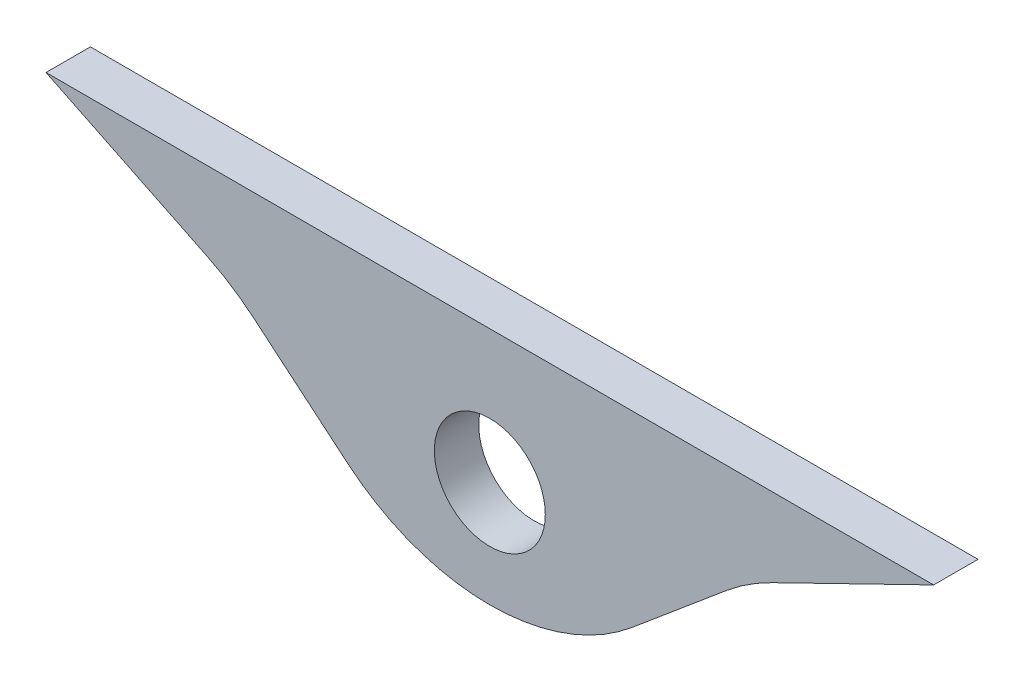
ISO-10303-21;
HEADER;
FILE_DESCRIPTION(('STEP AP214'),'2;1');
FILE_NAME('part.step','',(''),(''),'','','');
FILE_SCHEMA(('AUTOMOTIVE_DESIGN { 1 0 10303 214 1 1 1 1 }'));
ENDSEC;
DATA;
#1=APPLICATION_CONTEXT('core data for automotive mechanical design processes');
#2=APPLICATION_PROTOCOL_DEFINITION('international standard','automotive_design',2000,#1);
#3=PRODUCT_CONTEXT('',#1,'mechanical');
#4=PRODUCT('Part','Part','',(#3));
#5=PRODUCT_RELATED_PRODUCT_CATEGORY('part','',(#4));
#6=PRODUCT_DEFINITION_FORMATION('','',#4);
#7=PRODUCT_DEFINITION_CONTEXT('part definition',#1,'design');
#8=PRODUCT_DEFINITION('design','',#6,#7);
#9=PRODUCT_DEFINITION_SHAPE('','',#8);
#10=(LENGTH_UNIT() NAMED_UNIT(*) SI_UNIT(.MILLI.,.METRE.));
#11=(NAMED_UNIT(*) PLANE_ANGLE_UNIT() SI_UNIT($,.RADIAN.));
#12=(NAMED_UNIT(*) SI_UNIT($,.STERADIAN.) SOLID_ANGLE_UNIT());
#13=UNCERTAINTY_MEASURE_WITH_UNIT(LENGTH_MEASURE(1.E-05),#10,'distance_accuracy_value','');
#14=(GEOMETRIC_REPRESENTATION_CONTEXT(3) GLOBAL_UNCERTAINTY_ASSIGNED_CONTEXT((#13)) GLOBAL_UNIT_ASSIGNED_CONTEXT((#10,
#11,#12)) REPRESENTATION_CONTEXT('',''));
#15=CARTESIAN_POINT('',(0.,0.,0.));
#16=DIRECTION('',(0.,0.,1.));
#17=DIRECTION('',(1.,0.,0.));
#18=AXIS2_PLACEMENT_3D('',#15,#16,#17);
#19=CARTESIAN_POINT('',(0.,0.,2.));
#20=DIRECTION('',(0.,0.,-1.));
#21=DIRECTION('',(-1.,0.,0.));
#22=AXIS2_PLACEMENT_3D('',#19,#20,#21);
#23=PLANE('',#22);
#24=DIRECTION('',(0.766044443118979,-0.642787609686538,0.));
#25=VECTOR('',#24,1.);
#26=CARTESIAN_POINT('',(0.,-7.83244373599366,2.));
#27=LINE('',#26,#25);
#28=CARTESIAN_POINT('',(-10.6649206794372,1.11648727265698,2.));
#29=VERTEX_POINT('',#28);
#30=CARTESIAN_POINT('',(-6.42787609686538,-2.43881527386068,2.));
#31=VERTEX_POINT('',#30);
#32=EDGE_CURVE('E156',#29,#31,#27,.T.);
#33=ORIENTED_EDGE('',*,*,#32,.T.);
#34=CARTESIAN_POINT('',(0.,5.22162915732911,2.));
#35=DIRECTION('',(0.,0.,-1.));
#36=DIRECTION('',(-1.,0.,0.));
#37=AXIS2_PLACEMENT_3D('',#34,#35,#36);
#38=CIRCLE('',#37,10.);
#39=CARTESIAN_POINT('',(6.42787609686538,-2.43881527386069,2.));
#40=VERTEX_POINT('',#39);
#41=EDGE_CURVE('E62',#31,#40,#38,.F.);
#42=ORIENTED_EDGE('',*,*,#41,.T.);
#43=DIRECTION('',(0.766044443118979,0.642787609686538,0.));
#44=VECTOR('',#43,1.);
#45=CARTESIAN_POINT('',(0.,-7.83244373599366,2.));
#46=LINE('',#45,#44);
#47=CARTESIAN_POINT('',(10.6649206794372,1.11648727265698,2.));
#48=VERTEX_POINT('',#47);
#49=EDGE_CURVE('E116',#40,#48,#46,.T.);
#50=ORIENTED_EDGE('',*,*,#49,.T.);
#51=CARTESIAN_POINT('',(17.0927967763026,-6.54395715853281,2.));
#52=DIRECTION('',(0.,0.,-1.));
#53=DIRECTION('',(-1.,0.,0.));
#54=AXIS2_PLACEMENT_3D('',#51,#52,#53);
#55=CIRCLE('',#54,10.);
#56=CARTESIAN_POINT('',(12.7090853084118,2.44398330445889,2.));
#57=VERTEX_POINT('',#56);
#58=EDGE_CURVE('E11',#48,#57,#55,.T.);
#59=ORIENTED_EDGE('',*,*,#58,.T.);
#60=DIRECTION('',(0.898794046299169,0.438371146789072,0.));
#61=VECTOR('',#60,1.);
#62=CARTESIAN_POINT('',(11.6055049852419,1.90573121674889,2.));
#63=LINE('',#62,#61);
#64=CARTESIAN_POINT('',(20.,6.,2.));
#65=VERTEX_POINT('',#64);
#66=EDGE_CURVE('E104',#57,#65,#63,.T.);
#67=ORIENTED_EDGE('',*,*,#66,.T.);
#68=DIRECTION('',(-1.,0.,0.));
#69=VECTOR('',#68,1.);
#70=CARTESIAN_POINT('',(20.,6.,2.));
#71=LINE('',#70,#69);
#72=CARTESIAN_POINT('',(-20.,6.,2.));
#73=VERTEX_POINT('',#72);
#74=EDGE_CURVE('E109',#65,#73,#71,.T.);
#75=ORIENTED_EDGE('',*,*,#74,.T.);
#76=DIRECTION('',(0.898794046299169,-0.438371146789072,0.));
#77=VECTOR('',#76,1.);
#78=CARTESIAN_POINT('',(-11.6055049852419,1.90573121674889,2.));
#79=LINE('',#78,#77);
#80=CARTESIAN_POINT('',(-12.7090853084118,2.44398330445889,2.));
#81=VERTEX_POINT('',#80);
#82=EDGE_CURVE('E133',#73,#81,#79,.T.);
#83=ORIENTED_EDGE('',*,*,#82,.T.);
#84=CARTESIAN_POINT('',(-17.0927967763026,-6.54395715853281,2.));
#85=DIRECTION('',(0.,0.,-1.));
#86=DIRECTION('',(-1.,0.,0.));
#87=AXIS2_PLACEMENT_3D('',#84,#85,#86);
#88=CIRCLE('',#87,10.);
#89=EDGE_CURVE('E185',#81,#29,#88,.T.);
#90=ORIENTED_EDGE('',*,*,#89,.T.);
#91=EDGE_LOOP('',(#33,#42,#50,#59,#67,#75,#83,#90));
#92=FACE_BOUND('',#91,.T.);
#93=CARTESIAN_POINT('',(0.,0.,2.));
#94=DIRECTION('',(0.,0.,1.));
#95=DIRECTION('',(1.,0.,0.));
#96=AXIS2_PLACEMENT_3D('',#93,#94,#95);
#97=CIRCLE('',#96,2.5);
#98=CARTESIAN_POINT('',(2.5,0.,2.));
#99=VERTEX_POINT('',#98);
#100=EDGE_CURVE('E144',#99,#99,#97,.T.);
#101=ORIENTED_EDGE('',*,*,#100,.F.);
#102=EDGE_LOOP('',(#101));
#103=FACE_BOUND('',#102,.T.);
#104=ADVANCED_FACE('F39',(#92,#103),#23,.F.);
#105=CARTESIAN_POINT('',(0.,0.,0.));
#106=DIRECTION('',(0.,0.,-1.));
#107=DIRECTION('',(-1.,0.,0.));
#108=AXIS2_PLACEMENT_3D('',#105,#106,#107);
#109=PLANE('',#108);
#110=DIRECTION('',(0.766044443118979,0.642787609686538,0.));
#111=VECTOR('',#110,1.);
#112=CARTESIAN_POINT('',(0.,-7.83244373599366,0.));
#113=LINE('',#112,#111);
#114=CARTESIAN_POINT('',(6.42787609686538,-2.43881527386069,0.));
#115=VERTEX_POINT('',#114);
#116=CARTESIAN_POINT('',(10.6649206794372,1.11648727265698,0.));
#117=VERTEX_POINT('',#116);
#118=EDGE_CURVE('E143',#115,#117,#113,.T.);
#119=ORIENTED_EDGE('',*,*,#118,.F.);
#120=CARTESIAN_POINT('',(0.,5.22162915732911,0.));
#121=DIRECTION('',(0.,0.,-1.));
#122=DIRECTION('',(-1.,0.,0.));
#123=AXIS2_PLACEMENT_3D('',#120,#121,#122);
#124=CIRCLE('',#123,10.);
#125=CARTESIAN_POINT('',(-6.42787609686538,-2.43881527386068,0.));
#126=VERTEX_POINT('',#125);
#127=EDGE_CURVE('E177',#115,#126,#124,.T.);
#128=ORIENTED_EDGE('',*,*,#127,.T.);
#129=DIRECTION('',(0.766044443118979,-0.642787609686538,0.));
#130=VECTOR('',#129,1.);
#131=CARTESIAN_POINT('',(0.,-7.83244373599366,0.));
#132=LINE('',#131,#130);
#133=CARTESIAN_POINT('',(-10.6649206794372,1.11648727265698,0.));
#134=VERTEX_POINT('',#133);
#135=EDGE_CURVE('E139',#134,#126,#132,.T.);
#136=ORIENTED_EDGE('',*,*,#135,.F.);
#137=CARTESIAN_POINT('',(-17.0927967763026,-6.54395715853281,0.));
#138=DIRECTION('',(0.,0.,-1.));
#139=DIRECTION('',(-1.,0.,0.));
#140=AXIS2_PLACEMENT_3D('',#137,#138,#139);
#141=CIRCLE('',#140,10.);
#142=CARTESIAN_POINT('',(-12.7090853084118,2.44398330445889,0.));
#143=VERTEX_POINT('',#142);
#144=EDGE_CURVE('E182',#134,#143,#141,.F.);
#145=ORIENTED_EDGE('',*,*,#144,.T.);
#146=DIRECTION('',(0.898794046299169,-0.438371146789072,0.));
#147=VECTOR('',#146,1.);
#148=CARTESIAN_POINT('',(-11.6055049852419,1.90573121674889,0.));
#149=LINE('',#148,#147);
#150=CARTESIAN_POINT('',(-20.,6.,0.));
#151=VERTEX_POINT('',#150);
#152=EDGE_CURVE('E152',#151,#143,#149,.T.);
#153=ORIENTED_EDGE('',*,*,#152,.F.);
#154=DIRECTION('',(-1.,0.,0.));
#155=VECTOR('',#154,1.);
#156=CARTESIAN_POINT('',(20.,6.,0.));
#157=LINE('',#156,#155);
#158=CARTESIAN_POINT('',(20.,6.,0.));
#159=VERTEX_POINT('',#158);
#160=EDGE_CURVE('E149',#159,#151,#157,.T.);
#161=ORIENTED_EDGE('',*,*,#160,.F.);
#162=DIRECTION('',(0.898794046299169,0.438371146789072,0.));
#163=VECTOR('',#162,1.);
#164=CARTESIAN_POINT('',(11.6055049852419,1.90573121674889,0.));
#165=LINE('',#164,#163);
#166=CARTESIAN_POINT('',(12.7090853084118,2.44398330445889,0.));
#167=VERTEX_POINT('',#166);
#168=EDGE_CURVE('E122',#167,#159,#165,.T.);
#169=ORIENTED_EDGE('',*,*,#168,.F.);
#170=CARTESIAN_POINT('',(17.0927967763026,-6.54395715853281,0.));
#171=DIRECTION('',(0.,0.,-1.));
#172=DIRECTION('',(-1.,0.,0.));
#173=AXIS2_PLACEMENT_3D('',#170,#171,#172);
#174=CIRCLE('',#173,10.);
#175=EDGE_CURVE('E48',#167,#117,#174,.F.);
#176=ORIENTED_EDGE('',*,*,#175,.T.);
#177=EDGE_LOOP('',(#119,#128,#136,#145,#153,#161,#169,#176));
#178=FACE_BOUND('',#177,.T.);
#179=CARTESIAN_POINT('',(0.,0.,0.));
#180=DIRECTION('',(0.,0.,1.));
#181=DIRECTION('',(1.,0.,0.));
#182=AXIS2_PLACEMENT_3D('',#179,#180,#181);
#183=CIRCLE('',#182,2.5);
#184=CARTESIAN_POINT('',(2.5,0.,0.));
#185=VERTEX_POINT('',#184);
#186=EDGE_CURVE('E240',#185,#185,#183,.T.);
#187=ORIENTED_EDGE('',*,*,#186,.T.);
#188=EDGE_LOOP('',(#187));
#189=FACE_BOUND('',#188,.T.);
#190=ADVANCED_FACE('F190',(#178,#189),#109,.T.);
#191=CARTESIAN_POINT('',(0.,-7.83244373599366,2.));
#192=DIRECTION('',(0.642787609686538,0.766044443118979,0.));
#193=DIRECTION('',(-0.766044443118979,0.642787609686538,0.));
#194=AXIS2_PLACEMENT_3D('',#191,#192,#193);
#195=PLANE('',#194);
#196=ORIENTED_EDGE('',*,*,#32,.F.);
#197=DIRECTION('',(0.,0.,-1.));
#198=VECTOR('',#197,1.);
#199=CARTESIAN_POINT('',(-10.6649206794372,1.11648727265699,0.));
#200=LINE('',#199,#198);
#201=EDGE_CURVE('E161',#29,#134,#200,.T.);
#202=ORIENTED_EDGE('',*,*,#201,.T.);
#203=ORIENTED_EDGE('',*,*,#135,.T.);
#204=DIRECTION('',(0.,0.,-1.));
#205=VECTOR('',#204,1.);
#206=CARTESIAN_POINT('',(-6.42787609686538,-2.43881527386068,2.));
#207=LINE('',#206,#205);
#208=EDGE_CURVE('E126',#126,#31,#207,.F.);
#209=ORIENTED_EDGE('',*,*,#208,.T.);
#210=EDGE_LOOP('',(#196,#202,#203,#209));
#211=FACE_BOUND('',#210,.T.);
#212=ADVANCED_FACE('F211',(#211),#195,.F.);
#213=CARTESIAN_POINT('',(0.,-7.83244373599366,2.));
#214=DIRECTION('',(-0.642787609686538,0.766044443118979,0.));
#215=DIRECTION('',(-0.766044443118979,-0.642787609686538,0.));
#216=AXIS2_PLACEMENT_3D('',#213,#214,#215);
#217=PLANE('',#216);
#218=ORIENTED_EDGE('',*,*,#118,.T.);
#219=DIRECTION('',(0.,0.,-1.));
#220=VECTOR('',#219,1.);
#221=CARTESIAN_POINT('',(10.6649206794372,1.11648727265699,2.));
#222=LINE('',#221,#220);
#223=EDGE_CURVE('E55',#117,#48,#222,.F.);
#224=ORIENTED_EDGE('',*,*,#223,.T.);
#225=ORIENTED_EDGE('',*,*,#49,.F.);
#226=DIRECTION('',(0.,0.,-1.));
#227=VECTOR('',#226,1.);
#228=CARTESIAN_POINT('',(6.42787609686538,-2.43881527386069,2.));
#229=LINE('',#228,#227);
#230=EDGE_CURVE('E171',#40,#115,#229,.T.);
#231=ORIENTED_EDGE('',*,*,#230,.T.);
#232=EDGE_LOOP('',(#218,#224,#225,#231));
#233=FACE_BOUND('',#232,.T.);
#234=ADVANCED_FACE('F193',(#233),#217,.F.);
#235=CARTESIAN_POINT('',(11.6055049852419,1.90573121674889,2.));
#236=DIRECTION('',(-0.438371146789072,0.89879404629917,0.));
#237=DIRECTION('',(-0.89879404629917,-0.438371146789072,0.));
#238=AXIS2_PLACEMENT_3D('',#235,#236,#237);
#239=PLANE('',#238);
#240=ORIENTED_EDGE('',*,*,#66,.F.);
#241=DIRECTION('',(0.,0.,-1.));
#242=VECTOR('',#241,1.);
#243=CARTESIAN_POINT('',(12.7090853084118,2.44398330445889,0.));
#244=LINE('',#243,#242);
#245=EDGE_CURVE('E168',#57,#167,#244,.T.);
#246=ORIENTED_EDGE('',*,*,#245,.T.);
#247=ORIENTED_EDGE('',*,*,#168,.T.);
#248=DIRECTION('',(0.,0.,-1.));
#249=VECTOR('',#248,1.);
#250=CARTESIAN_POINT('',(20.,6.,2.));
#251=LINE('',#250,#249);
#252=EDGE_CURVE('E119',#65,#159,#251,.T.);
#253=ORIENTED_EDGE('',*,*,#252,.F.);
#254=EDGE_LOOP('',(#240,#246,#247,#253));
#255=FACE_BOUND('',#254,.T.);
#256=ADVANCED_FACE('F120',(#255),#239,.F.);
#257=CARTESIAN_POINT('',(20.,6.,2.));
#258=DIRECTION('',(0.,-1.,0.));
#259=DIRECTION('',(0.,0.,-1.));
#260=AXIS2_PLACEMENT_3D('',#257,#258,#259);
#261=PLANE('',#260);
#262=ORIENTED_EDGE('',*,*,#160,.T.);
#263=DIRECTION('',(0.,0.,-1.));
#264=VECTOR('',#263,1.);
#265=CARTESIAN_POINT('',(-20.,6.,2.));
#266=LINE('',#265,#264);
#267=EDGE_CURVE('E127',#73,#151,#266,.T.);
#268=ORIENTED_EDGE('',*,*,#267,.F.);
#269=ORIENTED_EDGE('',*,*,#74,.F.);
#270=ORIENTED_EDGE('',*,*,#252,.T.);
#271=EDGE_LOOP('',(#262,#268,#269,#270));
#272=FACE_BOUND('',#271,.T.);
#273=ADVANCED_FACE('F129',(#272),#261,.F.);
#274=CARTESIAN_POINT('',(-11.6055049852419,1.90573121674889,2.));
#275=DIRECTION('',(0.438371146789072,0.89879404629917,0.));
#276=DIRECTION('',(-0.89879404629917,0.438371146789072,0.));
#277=AXIS2_PLACEMENT_3D('',#274,#275,#276);
#278=PLANE('',#277);
#279=ORIENTED_EDGE('',*,*,#152,.T.);
#280=DIRECTION('',(0.,0.,-1.));
#281=VECTOR('',#280,1.);
#282=CARTESIAN_POINT('',(-12.7090853084118,2.44398330445889,2.));
#283=LINE('',#282,#281);
#284=EDGE_CURVE('E165',#143,#81,#283,.F.);
#285=ORIENTED_EDGE('',*,*,#284,.T.);
#286=ORIENTED_EDGE('',*,*,#82,.F.);
#287=ORIENTED_EDGE('',*,*,#267,.T.);
#288=EDGE_LOOP('',(#279,#285,#286,#287));
#289=FACE_BOUND('',#288,.T.);
#290=ADVANCED_FACE('F215',(#289),#278,.F.);
#291=CARTESIAN_POINT('',(0.,0.,2.));
#292=DIRECTION('',(0.,0.,-1.));
#293=DIRECTION('',(-1.,0.,0.));
#294=AXIS2_PLACEMENT_3D('',#291,#292,#293);
#295=CYLINDRICAL_SURFACE('',#294,2.5);
#296=ORIENTED_EDGE('',*,*,#100,.T.);
#297=EDGE_LOOP('',(#296));
#298=FACE_BOUND('',#297,.T.);
#299=ORIENTED_EDGE('',*,*,#186,.F.);
#300=EDGE_LOOP('',(#299));
#301=FACE_BOUND('',#300,.T.);
#302=ADVANCED_FACE('F203',(#298,#301),#295,.F.);
#303=CARTESIAN_POINT('',(-17.0927967763026,-6.54395715853281,2.));
#304=DIRECTION('',(0.,0.,1.));
#305=DIRECTION('',(1.,0.,0.));
#306=AXIS2_PLACEMENT_3D('',#303,#304,#305);
#307=CYLINDRICAL_SURFACE('',#306,10.);
#308=ORIENTED_EDGE('',*,*,#89,.F.);
#309=ORIENTED_EDGE('',*,*,#284,.F.);
#310=ORIENTED_EDGE('',*,*,#144,.F.);
#311=ORIENTED_EDGE('',*,*,#201,.F.);
#312=EDGE_LOOP('',(#308,#309,#310,#311));
#313=FACE_BOUND('',#312,.T.);
#314=ADVANCED_FACE('F197',(#313),#307,.F.);
#315=CARTESIAN_POINT('',(17.0927967763026,-6.54395715853281,2.));
#316=DIRECTION('',(0.,0.,1.));
#317=DIRECTION('',(1.,0.,0.));
#318=AXIS2_PLACEMENT_3D('',#315,#316,#317);
#319=CYLINDRICAL_SURFACE('',#318,10.);
#320=ORIENTED_EDGE('',*,*,#58,.F.);
#321=ORIENTED_EDGE('',*,*,#223,.F.);
#322=ORIENTED_EDGE('',*,*,#175,.F.);
#323=ORIENTED_EDGE('',*,*,#245,.F.);
#324=EDGE_LOOP('',(#320,#321,#322,#323));
#325=FACE_BOUND('',#324,.T.);
#326=ADVANCED_FACE('F195',(#325),#319,.F.);
#327=CARTESIAN_POINT('',(0.,5.22162915732911,2.));
#328=DIRECTION('',(0.,0.,-1.));
#329=DIRECTION('',(-1.,0.,0.));
#330=AXIS2_PLACEMENT_3D('',#327,#328,#329);
#331=CYLINDRICAL_SURFACE('',#330,10.);
#332=ORIENTED_EDGE('',*,*,#41,.F.);
#333=ORIENTED_EDGE('',*,*,#208,.F.);
#334=ORIENTED_EDGE('',*,*,#127,.F.);
#335=ORIENTED_EDGE('',*,*,#230,.F.);
#336=EDGE_LOOP('',(#332,#333,#334,#335));
#337=FACE_BOUND('',#336,.T.);
#338=ADVANCED_FACE('F41',(#337),#331,.T.);
#339=CLOSED_SHELL('',(#104,#190,#212,#234,#256,#273,#290,#302,#314,#326,#338));
#340=MANIFOLD_SOLID_BREP('B2',#339);
#341=ADVANCED_BREP_SHAPE_REPRESENTATION('',(#18,#340),#14);
#342=SHAPE_DEFINITION_REPRESENTATION(#9,#341);
ENDSEC;
END-ISO-10303-21;
